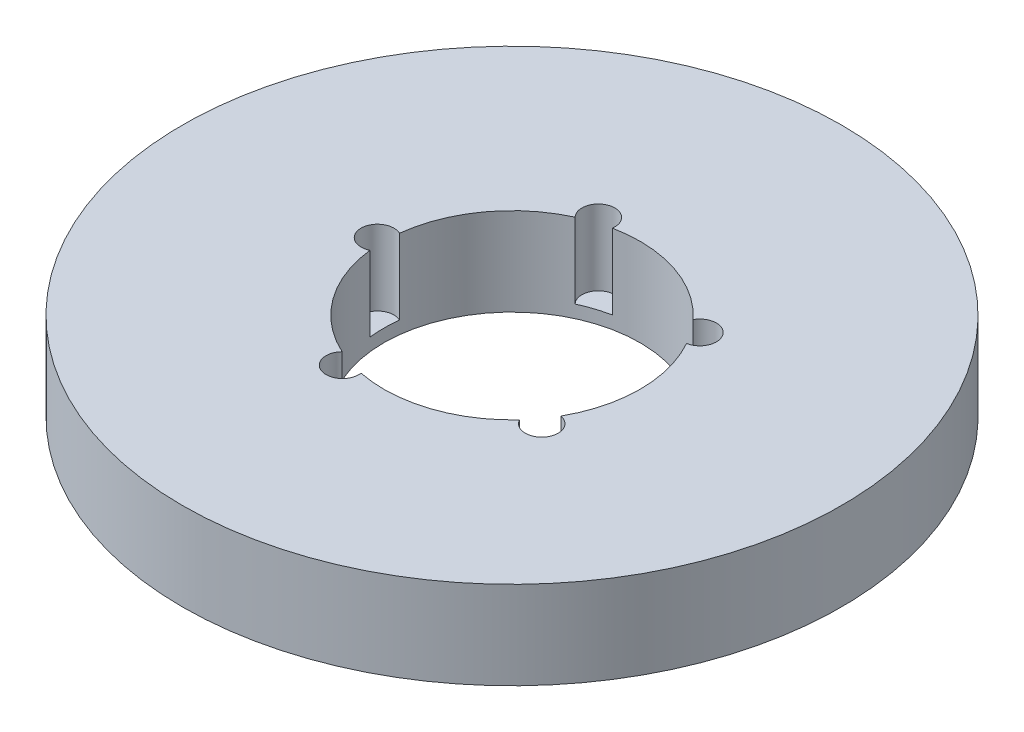
ISO-10303-21;
HEADER;
FILE_DESCRIPTION(('STEP AP214'),'2;1');
FILE_NAME('part.step','',(''),(''),'','','');
FILE_SCHEMA(('AUTOMOTIVE_DESIGN { 1 0 10303 214 1 1 1 1 }'));
ENDSEC;
DATA;
#1=APPLICATION_CONTEXT('core data for automotive mechanical design processes');
#2=APPLICATION_PROTOCOL_DEFINITION('international standard','automotive_design',2000,#1);
#3=PRODUCT_CONTEXT('',#1,'mechanical');
#4=PRODUCT('Part','Part','',(#3));
#5=PRODUCT_RELATED_PRODUCT_CATEGORY('part','',(#4));
#6=PRODUCT_DEFINITION_FORMATION('','',#4);
#7=PRODUCT_DEFINITION_CONTEXT('part definition',#1,'design');
#8=PRODUCT_DEFINITION('design','',#6,#7);
#9=PRODUCT_DEFINITION_SHAPE('','',#8);
#10=(LENGTH_UNIT() NAMED_UNIT(*) SI_UNIT(.MILLI.,.METRE.));
#11=(NAMED_UNIT(*) PLANE_ANGLE_UNIT() SI_UNIT($,.RADIAN.));
#12=(NAMED_UNIT(*) SI_UNIT($,.STERADIAN.) SOLID_ANGLE_UNIT());
#13=UNCERTAINTY_MEASURE_WITH_UNIT(LENGTH_MEASURE(1.E-05),#10,'distance_accuracy_value','');
#14=(GEOMETRIC_REPRESENTATION_CONTEXT(3) GLOBAL_UNCERTAINTY_ASSIGNED_CONTEXT((#13)) GLOBAL_UNIT_ASSIGNED_CONTEXT((#10,
#11,#12)) REPRESENTATION_CONTEXT('',''));
#15=CARTESIAN_POINT('',(0.,0.,0.));
#16=DIRECTION('',(0.,0.,1.));
#17=DIRECTION('',(1.,0.,0.));
#18=AXIS2_PLACEMENT_3D('',#15,#16,#17);
#19=CARTESIAN_POINT('',(0.,24.,0.));
#20=DIRECTION('',(0.,-1.,0.));
#21=DIRECTION('',(0.,0.,-1.));
#22=AXIS2_PLACEMENT_3D('',#19,#20,#21);
#23=CYLINDRICAL_SURFACE('',#22,90.);
#24=CARTESIAN_POINT('',(0.,24.,0.));
#25=DIRECTION('',(0.,1.,0.));
#26=DIRECTION('',(0.,0.,1.));
#27=AXIS2_PLACEMENT_3D('',#24,#25,#26);
#28=CIRCLE('',#27,90.);
#29=CARTESIAN_POINT('',(0.,24.,90.));
#30=VERTEX_POINT('',#29);
#31=EDGE_CURVE('E160',#30,#30,#28,.T.);
#32=ORIENTED_EDGE('',*,*,#31,.F.);
#33=EDGE_LOOP('',(#32));
#34=FACE_BOUND('',#33,.T.);
#35=CARTESIAN_POINT('',(0.,0.,0.));
#36=DIRECTION('',(0.,1.,0.));
#37=DIRECTION('',(0.,0.,1.));
#38=AXIS2_PLACEMENT_3D('',#35,#36,#37);
#39=CIRCLE('',#38,90.);
#40=CARTESIAN_POINT('',(0.,0.,90.));
#41=VERTEX_POINT('',#40);
#42=EDGE_CURVE('E153',#41,#41,#39,.T.);
#43=ORIENTED_EDGE('',*,*,#42,.T.);
#44=EDGE_LOOP('',(#43));
#45=FACE_BOUND('',#44,.T.);
#46=ADVANCED_FACE('F39',(#34,#45),#23,.T.);
#47=CARTESIAN_POINT('',(0.,24.,0.));
#48=DIRECTION('',(0.,1.,0.));
#49=DIRECTION('',(0.,0.,1.));
#50=AXIS2_PLACEMENT_3D('',#47,#48,#49);
#51=PLANE('',#50);
#52=CARTESIAN_POINT('',(-11.3525117188685,24.,34.9394384227511));
#53=DIRECTION('',(0.,1.,0.));
#54=DIRECTION('',(0.951056516295155,0.,0.309016994374945));
#55=AXIS2_PLACEMENT_3D('',#52,#53,#54);
#56=CIRCLE('',#55,4.49052619706274);
#57=CARTESIAN_POINT('',(-14.5809168157911,24.,31.8181844989777));
#58=VERTEX_POINT('',#57);
#59=CARTESIAN_POINT('',(-6.9060501056774,24.,34.3118998590558));
#60=VERTEX_POINT('',#59);
#61=EDGE_CURVE('E186',#58,#60,#56,.T.);
#62=ORIENTED_EDGE('',*,*,#61,.F.);
#63=CARTESIAN_POINT('',(0.,24.,0.));
#64=DIRECTION('',(0.,1.,0.));
#65=DIRECTION('',(0.,0.,1.));
#66=AXIS2_PLACEMENT_3D('',#63,#64,#65);
#67=CIRCLE('',#66,35.);
#68=CARTESIAN_POINT('',(-34.766642794081,24.,4.03491621087418));
#69=VERTEX_POINT('',#68);
#70=EDGE_CURVE('E148',#69,#58,#67,.T.);
#71=ORIENTED_EDGE('',*,*,#70,.F.);
#72=CARTESIAN_POINT('',(-36.7374996376218,24.,0.));
#73=DIRECTION('',(0.,1.,0.));
#74=DIRECTION('',(0.,0.,1.));
#75=AXIS2_PLACEMENT_3D('',#72,#73,#74);
#76=CIRCLE('',#75,4.49052619706274);
#77=CARTESIAN_POINT('',(-34.766642794081,24.,-4.03491621087418));
#78=VERTEX_POINT('',#77);
#79=EDGE_CURVE('E142',#78,#69,#76,.T.);
#80=ORIENTED_EDGE('',*,*,#79,.F.);
#81=CARTESIAN_POINT('',(-14.5809168157915,24.,-31.8181844989774));
#82=VERTEX_POINT('',#81);
#83=EDGE_CURVE('E132',#82,#78,#67,.T.);
#84=ORIENTED_EDGE('',*,*,#83,.F.);
#85=CARTESIAN_POINT('',(-11.352511718869,24.,-34.9394384227509));
#86=DIRECTION('',(0.,1.,0.));
#87=DIRECTION('',(-0.95105651629515,0.,0.309016994374958));
#88=AXIS2_PLACEMENT_3D('',#85,#86,#87);
#89=CIRCLE('',#88,4.49052619706274);
#90=CARTESIAN_POINT('',(-6.90605010567789,24.,-34.3118998590557));
#91=VERTEX_POINT('',#90);
#92=EDGE_CURVE('E111',#91,#82,#89,.T.);
#93=ORIENTED_EDGE('',*,*,#92,.F.);
#94=CARTESIAN_POINT('',(25.755140614787,24.,-23.6996356915576));
#95=VERTEX_POINT('',#94);
#96=EDGE_CURVE('E141',#95,#91,#67,.T.);
#97=ORIENTED_EDGE('',*,*,#96,.F.);
#98=CARTESIAN_POINT('',(29.7212615376793,24.,-21.5937604930944));
#99=DIRECTION('',(0.,1.,0.));
#100=DIRECTION('',(-0.58778525229248,0.,-0.809016994374942));
#101=AXIS2_PLACEMENT_3D('',#98,#99,#100);
#102=CIRCLE('',#101,4.49052619706274);
#103=CARTESIAN_POINT('',(30.4984691007624,24.,-17.1710041206053));
#104=VERTEX_POINT('',#103);
#105=EDGE_CURVE('E173',#104,#95,#102,.T.);
#106=ORIENTED_EDGE('',*,*,#105,.F.);
#107=CARTESIAN_POINT('',(30.4984691007626,24.,17.1710041206048));
#108=VERTEX_POINT('',#107);
#109=EDGE_CURVE('E150',#108,#104,#67,.T.);
#110=ORIENTED_EDGE('',*,*,#109,.F.);
#111=CARTESIAN_POINT('',(29.7212615376796,24.,21.593760493094));
#112=DIRECTION('',(0.,1.,0.));
#113=DIRECTION('',(0.587785252292469,0.,-0.809016994374951));
#114=AXIS2_PLACEMENT_3D('',#111,#112,#113);
#115=CIRCLE('',#114,4.49052619706274);
#116=CARTESIAN_POINT('',(25.7551406147873,24.,23.6996356915572));
#117=VERTEX_POINT('',#116);
#118=EDGE_CURVE('E172',#117,#108,#115,.T.);
#119=ORIENTED_EDGE('',*,*,#118,.F.);
#120=EDGE_CURVE('E152',#60,#117,#67,.T.);
#121=ORIENTED_EDGE('',*,*,#120,.F.);
#122=EDGE_LOOP('',(#62,#71,#80,#84,#93,#97,#106,#110,#119,#121));
#123=FACE_BOUND('',#122,.T.);
#124=ORIENTED_EDGE('',*,*,#31,.T.);
#125=EDGE_LOOP('',(#124));
#126=FACE_BOUND('',#125,.T.);
#127=ADVANCED_FACE('F138',(#123,#126),#51,.T.);
#128=CARTESIAN_POINT('',(0.,0.,0.));
#129=DIRECTION('',(0.,1.,0.));
#130=DIRECTION('',(0.,0.,1.));
#131=AXIS2_PLACEMENT_3D('',#128,#129,#130);
#132=PLANE('',#131);
#133=CARTESIAN_POINT('',(0.,0.,0.));
#134=DIRECTION('',(0.,1.,0.));
#135=DIRECTION('',(0.,0.,1.));
#136=AXIS2_PLACEMENT_3D('',#133,#134,#135);
#137=CIRCLE('',#136,35.);
#138=CARTESIAN_POINT('',(0.,0.,35.));
#139=VERTEX_POINT('',#138);
#140=EDGE_CURVE('E145',#139,#139,#137,.T.);
#141=ORIENTED_EDGE('',*,*,#140,.T.);
#142=EDGE_LOOP('',(#141));
#143=FACE_BOUND('',#142,.T.);
#144=ORIENTED_EDGE('',*,*,#42,.F.);
#145=EDGE_LOOP('',(#144));
#146=FACE_BOUND('',#145,.T.);
#147=ADVANCED_FACE('F216',(#143,#146),#132,.F.);
#148=CARTESIAN_POINT('',(0.,24.,0.));
#149=DIRECTION('',(0.,-1.,0.));
#150=DIRECTION('',(0.,0.,-1.));
#151=AXIS2_PLACEMENT_3D('',#148,#149,#150);
#152=CYLINDRICAL_SURFACE('',#151,35.);
#153=DIRECTION('',(0.,1.,0.));
#154=VECTOR('',#153,1.);
#155=CARTESIAN_POINT('',(-14.5809168157911,13.7310778433308,31.8181844989777));
#156=LINE('',#155,#154);
#157=CARTESIAN_POINT('',(-14.5809168157911,3.46215568666165,31.8181844989777));
#158=VERTEX_POINT('',#157);
#159=EDGE_CURVE('E11',#158,#58,#156,.T.);
#160=ORIENTED_EDGE('',*,*,#159,.F.);
#161=CARTESIAN_POINT('',(0.,3.46215568666165,0.));
#162=DIRECTION('',(0.,1.,0.));
#163=DIRECTION('',(0.,0.,1.));
#164=AXIS2_PLACEMENT_3D('',#161,#162,#163);
#165=CIRCLE('',#164,35.);
#166=CARTESIAN_POINT('',(-6.9060501056774,3.46215568666165,34.3118998590558));
#167=VERTEX_POINT('',#166);
#168=EDGE_CURVE('E192',#158,#167,#165,.T.);
#169=ORIENTED_EDGE('',*,*,#168,.T.);
#170=DIRECTION('',(0.,1.,0.));
#171=VECTOR('',#170,1.);
#172=CARTESIAN_POINT('',(-6.9060501056774,13.7310778433308,34.3118998590558));
#173=LINE('',#172,#171);
#174=EDGE_CURVE('E46',#60,#167,#173,.F.);
#175=ORIENTED_EDGE('',*,*,#174,.F.);
#176=ORIENTED_EDGE('',*,*,#120,.T.);
#177=DIRECTION('',(0.,1.,0.));
#178=VECTOR('',#177,1.);
#179=CARTESIAN_POINT('',(25.7551406147873,13.7310778433308,23.6996356915573));
#180=LINE('',#179,#178);
#181=CARTESIAN_POINT('',(25.7551406147873,3.46215568666165,23.6996356915572));
#182=VERTEX_POINT('',#181);
#183=EDGE_CURVE('E195',#182,#117,#180,.T.);
#184=ORIENTED_EDGE('',*,*,#183,.F.);
#185=CARTESIAN_POINT('',(0.,3.46215568666165,0.));
#186=DIRECTION('',(0.,1.,0.));
#187=DIRECTION('',(0.,0.,1.));
#188=AXIS2_PLACEMENT_3D('',#185,#186,#187);
#189=CIRCLE('',#188,35.);
#190=CARTESIAN_POINT('',(30.4984691007626,3.46215568666165,17.1710041206048));
#191=VERTEX_POINT('',#190);
#192=EDGE_CURVE('E197',#182,#191,#189,.T.);
#193=ORIENTED_EDGE('',*,*,#192,.T.);
#194=DIRECTION('',(0.,1.,0.));
#195=VECTOR('',#194,1.);
#196=CARTESIAN_POINT('',(30.4984691007626,13.7310778433308,17.1710041206048));
#197=LINE('',#196,#195);
#198=EDGE_CURVE('E168',#108,#191,#197,.F.);
#199=ORIENTED_EDGE('',*,*,#198,.F.);
#200=ORIENTED_EDGE('',*,*,#109,.T.);
#201=DIRECTION('',(0.,1.,0.));
#202=VECTOR('',#201,1.);
#203=CARTESIAN_POINT('',(30.4984691007624,13.7310778433308,-17.1710041206053));
#204=LINE('',#203,#202);
#205=CARTESIAN_POINT('',(30.4984691007624,3.46215568666165,-17.1710041206053));
#206=VERTEX_POINT('',#205);
#207=EDGE_CURVE('E169',#206,#104,#204,.T.);
#208=ORIENTED_EDGE('',*,*,#207,.F.);
#209=CARTESIAN_POINT('',(0.,3.46215568666165,0.));
#210=DIRECTION('',(0.,1.,0.));
#211=DIRECTION('',(0.,0.,1.));
#212=AXIS2_PLACEMENT_3D('',#209,#210,#211);
#213=CIRCLE('',#212,35.);
#214=CARTESIAN_POINT('',(25.755140614787,3.46215568666165,-23.6996356915576));
#215=VERTEX_POINT('',#214);
#216=EDGE_CURVE('E332',#206,#215,#213,.T.);
#217=ORIENTED_EDGE('',*,*,#216,.T.);
#218=DIRECTION('',(0.,1.,0.));
#219=VECTOR('',#218,1.);
#220=CARTESIAN_POINT('',(25.755140614787,13.7310778433308,-23.6996356915576));
#221=LINE('',#220,#219);
#222=EDGE_CURVE('E335',#95,#215,#221,.F.);
#223=ORIENTED_EDGE('',*,*,#222,.F.);
#224=ORIENTED_EDGE('',*,*,#96,.T.);
#225=DIRECTION('',(0.,1.,0.));
#226=VECTOR('',#225,1.);
#227=CARTESIAN_POINT('',(-6.90605010567789,13.7310778433308,-34.3118998590557));
#228=LINE('',#227,#226);
#229=CARTESIAN_POINT('',(-6.90605010567789,3.46215568666165,-34.3118998590557));
#230=VERTEX_POINT('',#229);
#231=EDGE_CURVE('E121',#230,#91,#228,.T.);
#232=ORIENTED_EDGE('',*,*,#231,.F.);
#233=CARTESIAN_POINT('',(0.,3.46215568666165,0.));
#234=DIRECTION('',(0.,1.,0.));
#235=DIRECTION('',(0.,0.,1.));
#236=AXIS2_PLACEMENT_3D('',#233,#234,#235);
#237=CIRCLE('',#236,35.);
#238=CARTESIAN_POINT('',(-14.5809168157915,3.46215568666165,-31.8181844989774));
#239=VERTEX_POINT('',#238);
#240=EDGE_CURVE('E134',#230,#239,#237,.T.);
#241=ORIENTED_EDGE('',*,*,#240,.T.);
#242=DIRECTION('',(0.,1.,0.));
#243=VECTOR('',#242,1.);
#244=CARTESIAN_POINT('',(-14.5809168157916,13.7310778433308,-31.8181844989774));
#245=LINE('',#244,#243);
#246=EDGE_CURVE('E117',#82,#239,#245,.F.);
#247=ORIENTED_EDGE('',*,*,#246,.F.);
#248=ORIENTED_EDGE('',*,*,#83,.T.);
#249=DIRECTION('',(0.,1.,0.));
#250=VECTOR('',#249,1.);
#251=CARTESIAN_POINT('',(-34.766642794081,13.7310778433308,-4.03491621087419));
#252=LINE('',#251,#250);
#253=CARTESIAN_POINT('',(-34.766642794081,3.46215568666165,-4.03491621087418));
#254=VERTEX_POINT('',#253);
#255=EDGE_CURVE('E338',#254,#78,#252,.T.);
#256=ORIENTED_EDGE('',*,*,#255,.F.);
#257=CARTESIAN_POINT('',(0.,3.46215568666165,0.));
#258=DIRECTION('',(0.,1.,0.));
#259=DIRECTION('',(0.,0.,1.));
#260=AXIS2_PLACEMENT_3D('',#257,#258,#259);
#261=CIRCLE('',#260,35.);
#262=CARTESIAN_POINT('',(-34.766642794081,3.46215568666165,4.03491621087418));
#263=VERTEX_POINT('',#262);
#264=EDGE_CURVE('E342',#254,#263,#261,.T.);
#265=ORIENTED_EDGE('',*,*,#264,.T.);
#266=DIRECTION('',(0.,1.,0.));
#267=VECTOR('',#266,1.);
#268=CARTESIAN_POINT('',(-34.766642794081,13.7310778433308,4.03491621087419));
#269=LINE('',#268,#267);
#270=EDGE_CURVE('E341',#69,#263,#269,.F.);
#271=ORIENTED_EDGE('',*,*,#270,.F.);
#272=ORIENTED_EDGE('',*,*,#70,.T.);
#273=EDGE_LOOP('',(#160,#169,#175,#176,#184,#193,#199,#200,#208,#217,#223,#224,#232,#241,#247,
#248,#256,#265,#271,#272));
#274=FACE_BOUND('',#273,.T.);
#275=ORIENTED_EDGE('',*,*,#140,.F.);
#276=EDGE_LOOP('',(#275));
#277=FACE_BOUND('',#276,.T.);
#278=ADVANCED_FACE('F128',(#274,#277),#152,.F.);
#279=CARTESIAN_POINT('',(-36.7374996376218,3.46215568666165,0.));
#280=DIRECTION('',(0.,1.,0.));
#281=DIRECTION('',(0.,0.,1.));
#282=AXIS2_PLACEMENT_3D('',#279,#280,#281);
#283=CYLINDRICAL_SURFACE('',#282,4.49052619706274);
#284=ORIENTED_EDGE('',*,*,#255,.T.);
#285=ORIENTED_EDGE('',*,*,#79,.T.);
#286=ORIENTED_EDGE('',*,*,#270,.T.);
#287=CARTESIAN_POINT('',(-36.7374996376218,3.46215568666165,0.));
#288=DIRECTION('',(0.,1.,0.));
#289=DIRECTION('',(0.,0.,1.));
#290=AXIS2_PLACEMENT_3D('',#287,#288,#289);
#291=CIRCLE('',#290,4.49052619706274);
#292=EDGE_CURVE('E149',#254,#263,#291,.T.);
#293=ORIENTED_EDGE('',*,*,#292,.F.);
#294=EDGE_LOOP('',(#284,#285,#286,#293));
#295=FACE_BOUND('',#294,.T.);
#296=ADVANCED_FACE('F227',(#295),#283,.F.);
#297=CARTESIAN_POINT('',(-36.7374996376218,3.46215568666165,0.));
#298=DIRECTION('',(0.,1.,0.));
#299=DIRECTION('',(0.,0.,1.));
#300=AXIS2_PLACEMENT_3D('',#297,#298,#299);
#301=PLANE('',#300);
#302=ORIENTED_EDGE('',*,*,#292,.T.);
#303=ORIENTED_EDGE('',*,*,#264,.F.);
#304=EDGE_LOOP('',(#302,#303));
#305=FACE_BOUND('',#304,.T.);
#306=ADVANCED_FACE('F235',(#305),#301,.T.);
#307=CARTESIAN_POINT('',(-11.352511718869,3.46215568666165,-34.9394384227509));
#308=DIRECTION('',(0.,1.,0.));
#309=DIRECTION('',(0.,0.,1.));
#310=AXIS2_PLACEMENT_3D('',#307,#308,#309);
#311=CYLINDRICAL_SURFACE('',#310,4.49052619706274);
#312=ORIENTED_EDGE('',*,*,#231,.T.);
#313=ORIENTED_EDGE('',*,*,#92,.T.);
#314=ORIENTED_EDGE('',*,*,#246,.T.);
#315=CARTESIAN_POINT('',(-11.352511718869,3.46215568666165,-34.9394384227509));
#316=DIRECTION('',(0.,1.,0.));
#317=DIRECTION('',(-0.95105651629515,0.,0.309016994374958));
#318=AXIS2_PLACEMENT_3D('',#315,#316,#317);
#319=CIRCLE('',#318,4.49052619706274);
#320=EDGE_CURVE('E127',#230,#239,#319,.T.);
#321=ORIENTED_EDGE('',*,*,#320,.F.);
#322=EDGE_LOOP('',(#312,#313,#314,#321));
#323=FACE_BOUND('',#322,.T.);
#324=ADVANCED_FACE('F116',(#323),#311,.F.);
#325=CARTESIAN_POINT('',(-11.352511718869,3.46215568666165,-34.9394384227509));
#326=DIRECTION('',(0.,1.,0.));
#327=DIRECTION('',(-0.95105651629515,0.,0.309016994374958));
#328=AXIS2_PLACEMENT_3D('',#325,#326,#327);
#329=PLANE('',#328);
#330=ORIENTED_EDGE('',*,*,#320,.T.);
#331=ORIENTED_EDGE('',*,*,#240,.F.);
#332=EDGE_LOOP('',(#330,#331));
#333=FACE_BOUND('',#332,.T.);
#334=ADVANCED_FACE('F236',(#333),#329,.T.);
#335=CARTESIAN_POINT('',(29.7212615376793,3.46215568666165,-21.5937604930944));
#336=DIRECTION('',(0.,1.,0.));
#337=DIRECTION('',(0.,0.,1.));
#338=AXIS2_PLACEMENT_3D('',#335,#336,#337);
#339=CYLINDRICAL_SURFACE('',#338,4.49052619706274);
#340=ORIENTED_EDGE('',*,*,#207,.T.);
#341=ORIENTED_EDGE('',*,*,#105,.T.);
#342=ORIENTED_EDGE('',*,*,#222,.T.);
#343=CARTESIAN_POINT('',(29.7212615376793,3.46215568666165,-21.5937604930944));
#344=DIRECTION('',(0.,1.,0.));
#345=DIRECTION('',(-0.58778525229248,0.,-0.809016994374942));
#346=AXIS2_PLACEMENT_3D('',#343,#344,#345);
#347=CIRCLE('',#346,4.49052619706274);
#348=EDGE_CURVE('E177',#206,#215,#347,.T.);
#349=ORIENTED_EDGE('',*,*,#348,.F.);
#350=EDGE_LOOP('',(#340,#341,#342,#349));
#351=FACE_BOUND('',#350,.T.);
#352=ADVANCED_FACE('F241',(#351),#339,.F.);
#353=CARTESIAN_POINT('',(29.7212615376793,3.46215568666165,-21.5937604930944));
#354=DIRECTION('',(0.,1.,0.));
#355=DIRECTION('',(-0.58778525229248,0.,-0.809016994374942));
#356=AXIS2_PLACEMENT_3D('',#353,#354,#355);
#357=PLANE('',#356);
#358=ORIENTED_EDGE('',*,*,#348,.T.);
#359=ORIENTED_EDGE('',*,*,#216,.F.);
#360=EDGE_LOOP('',(#358,#359));
#361=FACE_BOUND('',#360,.T.);
#362=ADVANCED_FACE('F244',(#361),#357,.T.);
#363=CARTESIAN_POINT('',(29.7212615376796,3.46215568666165,21.593760493094));
#364=DIRECTION('',(0.,1.,0.));
#365=DIRECTION('',(0.,0.,1.));
#366=AXIS2_PLACEMENT_3D('',#363,#364,#365);
#367=CYLINDRICAL_SURFACE('',#366,4.49052619706274);
#368=ORIENTED_EDGE('',*,*,#183,.T.);
#369=ORIENTED_EDGE('',*,*,#118,.T.);
#370=ORIENTED_EDGE('',*,*,#198,.T.);
#371=CARTESIAN_POINT('',(29.7212615376796,3.46215568666165,21.593760493094));
#372=DIRECTION('',(0.,1.,0.));
#373=DIRECTION('',(0.587785252292469,0.,-0.809016994374951));
#374=AXIS2_PLACEMENT_3D('',#371,#372,#373);
#375=CIRCLE('',#374,4.49052619706274);
#376=EDGE_CURVE('E56',#182,#191,#375,.T.);
#377=ORIENTED_EDGE('',*,*,#376,.F.);
#378=EDGE_LOOP('',(#368,#369,#370,#377));
#379=FACE_BOUND('',#378,.T.);
#380=ADVANCED_FACE('F191',(#379),#367,.F.);
#381=CARTESIAN_POINT('',(29.7212615376796,3.46215568666165,21.593760493094));
#382=DIRECTION('',(0.,1.,0.));
#383=DIRECTION('',(0.587785252292469,0.,-0.809016994374951));
#384=AXIS2_PLACEMENT_3D('',#381,#382,#383);
#385=PLANE('',#384);
#386=ORIENTED_EDGE('',*,*,#376,.T.);
#387=ORIENTED_EDGE('',*,*,#192,.F.);
#388=EDGE_LOOP('',(#386,#387));
#389=FACE_BOUND('',#388,.T.);
#390=ADVANCED_FACE('F208',(#389),#385,.T.);
#391=CARTESIAN_POINT('',(-11.3525117188685,3.46215568666165,34.9394384227511));
#392=DIRECTION('',(0.,1.,0.));
#393=DIRECTION('',(0.,0.,1.));
#394=AXIS2_PLACEMENT_3D('',#391,#392,#393);
#395=CYLINDRICAL_SURFACE('',#394,4.49052619706274);
#396=ORIENTED_EDGE('',*,*,#159,.T.);
#397=ORIENTED_EDGE('',*,*,#61,.T.);
#398=ORIENTED_EDGE('',*,*,#174,.T.);
#399=CARTESIAN_POINT('',(-11.3525117188685,3.46215568666165,34.9394384227511));
#400=DIRECTION('',(0.,1.,0.));
#401=DIRECTION('',(0.951056516295155,0.,0.309016994374945));
#402=AXIS2_PLACEMENT_3D('',#399,#400,#401);
#403=CIRCLE('',#402,4.49052619706274);
#404=EDGE_CURVE('E55',#158,#167,#403,.T.);
#405=ORIENTED_EDGE('',*,*,#404,.F.);
#406=EDGE_LOOP('',(#396,#397,#398,#405));
#407=FACE_BOUND('',#406,.T.);
#408=ADVANCED_FACE('F203',(#407),#395,.F.);
#409=CARTESIAN_POINT('',(-11.3525117188685,3.46215568666165,34.9394384227511));
#410=DIRECTION('',(0.,1.,0.));
#411=DIRECTION('',(0.951056516295155,0.,0.309016994374945));
#412=AXIS2_PLACEMENT_3D('',#409,#410,#411);
#413=PLANE('',#412);
#414=ORIENTED_EDGE('',*,*,#404,.T.);
#415=ORIENTED_EDGE('',*,*,#168,.F.);
#416=EDGE_LOOP('',(#414,#415));
#417=FACE_BOUND('',#416,.T.);
#418=ADVANCED_FACE('F205',(#417),#413,.T.);
#419=CLOSED_SHELL('',(#46,#127,#147,#278,#296,#306,#324,#334,#352,#362,#380,#390,#408,#418));
#420=MANIFOLD_SOLID_BREP('B2',#419);
#421=ADVANCED_BREP_SHAPE_REPRESENTATION('',(#18,#420),#14);
#422=SHAPE_DEFINITION_REPRESENTATION(#9,#421);
ENDSEC;
END-ISO-10303-21;
